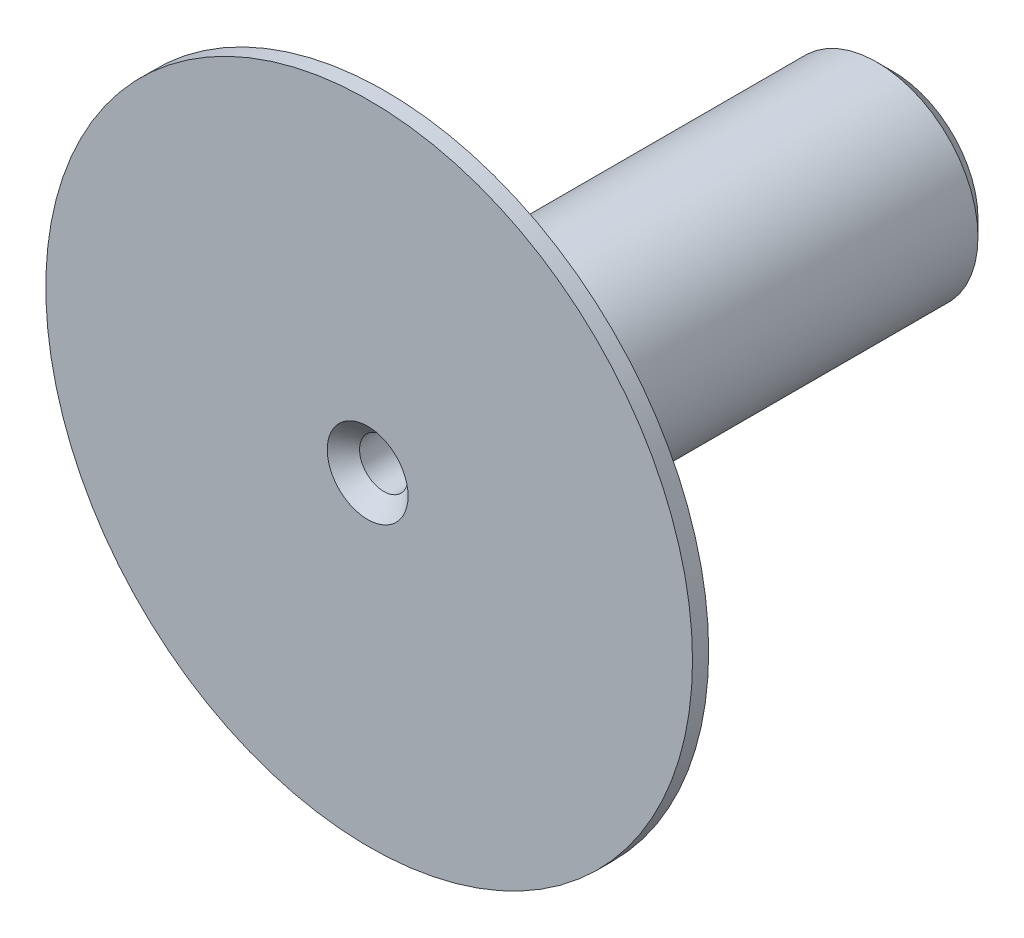
ISO-10303-21;
HEADER;
FILE_DESCRIPTION(('STEP AP214'),'2;1');
FILE_NAME('part.step','',(''),(''),'','','');
FILE_SCHEMA(('AUTOMOTIVE_DESIGN { 1 0 10303 214 1 1 1 1 }'));
ENDSEC;
DATA;
#1=APPLICATION_CONTEXT('core data for automotive mechanical design processes');
#2=APPLICATION_PROTOCOL_DEFINITION('international standard','automotive_design',2000,#1);
#3=PRODUCT_CONTEXT('',#1,'mechanical');
#4=PRODUCT('Part','Part','',(#3));
#5=PRODUCT_RELATED_PRODUCT_CATEGORY('part','',(#4));
#6=PRODUCT_DEFINITION_FORMATION('','',#4);
#7=PRODUCT_DEFINITION_CONTEXT('part definition',#1,'design');
#8=PRODUCT_DEFINITION('design','',#6,#7);
#9=PRODUCT_DEFINITION_SHAPE('','',#8);
#10=(LENGTH_UNIT() NAMED_UNIT(*) SI_UNIT(.MILLI.,.METRE.));
#11=(NAMED_UNIT(*) PLANE_ANGLE_UNIT() SI_UNIT($,.RADIAN.));
#12=(NAMED_UNIT(*) SI_UNIT($,.STERADIAN.) SOLID_ANGLE_UNIT());
#13=UNCERTAINTY_MEASURE_WITH_UNIT(LENGTH_MEASURE(1.E-05),#10,'distance_accuracy_value','');
#14=(GEOMETRIC_REPRESENTATION_CONTEXT(3) GLOBAL_UNCERTAINTY_ASSIGNED_CONTEXT((#13)) GLOBAL_UNIT_ASSIGNED_CONTEXT((#10,
#11,#12)) REPRESENTATION_CONTEXT('',''));
#15=CARTESIAN_POINT('',(0.,0.,0.));
#16=DIRECTION('',(0.,0.,1.));
#17=DIRECTION('',(1.,0.,0.));
#18=AXIS2_PLACEMENT_3D('',#15,#16,#17);
#19=CARTESIAN_POINT('',(0.,0.,6.5));
#20=DIRECTION('',(0.,0.,-1.));
#21=DIRECTION('',(-1.,0.,0.));
#22=AXIS2_PLACEMENT_3D('',#19,#20,#21);
#23=CYLINDRICAL_SURFACE('',#22,1.25);
#24=CARTESIAN_POINT('',(0.,0.,0.200000000000007));
#25=DIRECTION('',(0.,0.,1.));
#26=DIRECTION('',(1.,0.,0.));
#27=AXIS2_PLACEMENT_3D('',#24,#25,#26);
#28=CIRCLE('',#27,1.25);
#29=CARTESIAN_POINT('',(1.25,0.,0.200000000000007));
#30=VERTEX_POINT('',#29);
#31=EDGE_CURVE('E65',#30,#30,#28,.T.);
#32=ORIENTED_EDGE('',*,*,#31,.T.);
#33=EDGE_LOOP('',(#32));
#34=FACE_BOUND('',#33,.T.);
#35=CARTESIAN_POINT('',(0.,0.,6.3));
#36=DIRECTION('',(0.,0.,1.));
#37=DIRECTION('',(1.,0.,0.));
#38=AXIS2_PLACEMENT_3D('',#35,#36,#37);
#39=CIRCLE('',#38,1.25);
#40=CARTESIAN_POINT('',(1.25,0.,6.3));
#41=VERTEX_POINT('',#40);
#42=EDGE_CURVE('E68',#41,#41,#39,.T.);
#43=ORIENTED_EDGE('',*,*,#42,.F.);
#44=EDGE_LOOP('',(#43));
#45=FACE_BOUND('',#44,.T.);
#46=ADVANCED_FACE('F41',(#34,#45),#23,.T.);
#47=CARTESIAN_POINT('',(0.,0.,6.5));
#48=DIRECTION('',(0.,0.,1.));
#49=DIRECTION('',(1.,0.,0.));
#50=AXIS2_PLACEMENT_3D('',#47,#48,#49);
#51=PLANE('',#50);
#52=CARTESIAN_POINT('',(0.,0.,6.5));
#53=DIRECTION('',(0.,0.,1.));
#54=DIRECTION('',(1.,0.,0.));
#55=AXIS2_PLACEMENT_3D('',#52,#53,#54);
#56=CIRCLE('',#55,0.500000000000011);
#57=CARTESIAN_POINT('',(0.500000000000011,0.,6.5));
#58=VERTEX_POINT('',#57);
#59=EDGE_CURVE('E10',#58,#58,#56,.F.);
#60=ORIENTED_EDGE('',*,*,#59,.T.);
#61=EDGE_LOOP('',(#60));
#62=FACE_BOUND('',#61,.T.);
#63=CARTESIAN_POINT('',(0.0186698824009481,0.,6.5));
#64=DIRECTION('',(0.,0.,1.));
#65=DIRECTION('',(1.,0.,0.));
#66=AXIS2_PLACEMENT_3D('',#63,#64,#65);
#67=CIRCLE('',#66,4.);
#68=CARTESIAN_POINT('',(4.01866988240095,0.,6.5));
#69=VERTEX_POINT('',#68);
#70=EDGE_CURVE('E72',#69,#69,#67,.T.);
#71=ORIENTED_EDGE('',*,*,#70,.T.);
#72=EDGE_LOOP('',(#71));
#73=FACE_BOUND('',#72,.T.);
#74=ADVANCED_FACE('F96',(#62,#73),#51,.T.);
#75=CARTESIAN_POINT('',(0.,0.,0.));
#76=DIRECTION('',(0.,0.,1.));
#77=DIRECTION('',(1.,0.,0.));
#78=AXIS2_PLACEMENT_3D('',#75,#76,#77);
#79=PLANE('',#78);
#80=CARTESIAN_POINT('',(0.,0.,0.));
#81=DIRECTION('',(0.,0.,1.));
#82=DIRECTION('',(1.,0.,0.));
#83=AXIS2_PLACEMENT_3D('',#80,#81,#82);
#84=CIRCLE('',#83,1.04999999999999);
#85=CARTESIAN_POINT('',(1.04999999999999,0.,0.));
#86=VERTEX_POINT('',#85);
#87=EDGE_CURVE('E57',#86,#86,#84,.F.);
#88=ORIENTED_EDGE('',*,*,#87,.T.);
#89=EDGE_LOOP('',(#88));
#90=FACE_BOUND('',#89,.T.);
#91=CARTESIAN_POINT('',(0.,0.,0.));
#92=DIRECTION('',(0.,0.,1.));
#93=DIRECTION('',(1.,0.,0.));
#94=AXIS2_PLACEMENT_3D('',#91,#92,#93);
#95=CIRCLE('',#94,0.499999999999995);
#96=CARTESIAN_POINT('',(0.499999999999995,0.,0.));
#97=VERTEX_POINT('',#96);
#98=EDGE_CURVE('E62',#97,#97,#95,.T.);
#99=ORIENTED_EDGE('',*,*,#98,.T.);
#100=EDGE_LOOP('',(#99));
#101=FACE_BOUND('',#100,.T.);
#102=ADVANCED_FACE('F102',(#90,#101),#79,.F.);
#103=CARTESIAN_POINT('',(0.,0.,6.5));
#104=DIRECTION('',(0.,0.,-1.));
#105=DIRECTION('',(-1.,0.,0.));
#106=AXIS2_PLACEMENT_3D('',#103,#104,#105);
#107=CYLINDRICAL_SURFACE('',#106,0.3);
#108=CARTESIAN_POINT('',(0.,0.,0.199999999999999));
#109=DIRECTION('',(0.,0.,1.));
#110=DIRECTION('',(1.,0.,0.));
#111=AXIS2_PLACEMENT_3D('',#108,#109,#110);
#112=CIRCLE('',#111,0.3);
#113=CARTESIAN_POINT('',(0.3,0.,0.199999999999999));
#114=VERTEX_POINT('',#113);
#115=EDGE_CURVE('E49',#114,#114,#112,.F.);
#116=ORIENTED_EDGE('',*,*,#115,.T.);
#117=EDGE_LOOP('',(#116));
#118=FACE_BOUND('',#117,.T.);
#119=CARTESIAN_POINT('',(0.,0.,6.29999999999999));
#120=DIRECTION('',(0.,0.,1.));
#121=DIRECTION('',(1.,0.,0.));
#122=AXIS2_PLACEMENT_3D('',#119,#120,#121);
#123=CIRCLE('',#122,0.3);
#124=CARTESIAN_POINT('',(0.3,0.,6.29999999999999));
#125=VERTEX_POINT('',#124);
#126=EDGE_CURVE('E53',#125,#125,#123,.T.);
#127=ORIENTED_EDGE('',*,*,#126,.T.);
#128=EDGE_LOOP('',(#127));
#129=FACE_BOUND('',#128,.T.);
#130=ADVANCED_FACE('F94',(#118,#129),#107,.F.);
#131=CARTESIAN_POINT('',(0.0186698824009481,0.,6.3));
#132=DIRECTION('',(0.,0.,1.));
#133=DIRECTION('',(1.,0.,0.));
#134=AXIS2_PLACEMENT_3D('',#131,#132,#133);
#135=CYLINDRICAL_SURFACE('',#134,4.);
#136=CARTESIAN_POINT('',(0.0186698824009481,0.,6.3));
#137=DIRECTION('',(0.,0.,1.));
#138=DIRECTION('',(1.,0.,0.));
#139=AXIS2_PLACEMENT_3D('',#136,#137,#138);
#140=CIRCLE('',#139,4.);
#141=CARTESIAN_POINT('',(4.01866988240095,0.,6.3));
#142=VERTEX_POINT('',#141);
#143=EDGE_CURVE('E71',#142,#142,#140,.T.);
#144=ORIENTED_EDGE('',*,*,#143,.T.);
#145=EDGE_LOOP('',(#144));
#146=FACE_BOUND('',#145,.T.);
#147=ORIENTED_EDGE('',*,*,#70,.F.);
#148=EDGE_LOOP('',(#147));
#149=FACE_BOUND('',#148,.T.);
#150=ADVANCED_FACE('F78',(#146,#149),#135,.T.);
#151=CARTESIAN_POINT('',(0.0186698824009481,0.,6.3));
#152=DIRECTION('',(0.,0.,1.));
#153=DIRECTION('',(1.,0.,0.));
#154=AXIS2_PLACEMENT_3D('',#151,#152,#153);
#155=PLANE('',#154);
#156=ORIENTED_EDGE('',*,*,#42,.T.);
#157=EDGE_LOOP('',(#156));
#158=FACE_BOUND('',#157,.T.);
#159=ORIENTED_EDGE('',*,*,#143,.F.);
#160=EDGE_LOOP('',(#159));
#161=FACE_BOUND('',#160,.T.);
#162=ADVANCED_FACE('F81',(#158,#161),#155,.F.);
#163=CARTESIAN_POINT('',(0.,0.,0.200000000000007));
#164=DIRECTION('',(0.,0.,1.));
#165=DIRECTION('',(1.,0.,0.));
#166=AXIS2_PLACEMENT_3D('',#163,#164,#165);
#167=CONICAL_SURFACE('',#166,1.25,0.785398163397455);
#168=ORIENTED_EDGE('',*,*,#87,.F.);
#169=EDGE_LOOP('',(#168));
#170=FACE_BOUND('',#169,.T.);
#171=ORIENTED_EDGE('',*,*,#31,.F.);
#172=EDGE_LOOP('',(#171));
#173=FACE_BOUND('',#172,.T.);
#174=ADVANCED_FACE('F83',(#170,#173),#167,.T.);
#175=CARTESIAN_POINT('',(0.,0.,0.));
#176=DIRECTION('',(0.,0.,-1.));
#177=DIRECTION('',(-1.,0.,0.));
#178=AXIS2_PLACEMENT_3D('',#175,#176,#177);
#179=CONICAL_SURFACE('',#178,0.499999999999995,0.78539816339744);
#180=ORIENTED_EDGE('',*,*,#115,.F.);
#181=EDGE_LOOP('',(#180));
#182=FACE_BOUND('',#181,.T.);
#183=ORIENTED_EDGE('',*,*,#98,.F.);
#184=EDGE_LOOP('',(#183));
#185=FACE_BOUND('',#184,.T.);
#186=ADVANCED_FACE('F91',(#182,#185),#179,.F.);
#187=CARTESIAN_POINT('',(0.,0.,6.29999999999999));
#188=DIRECTION('',(0.,0.,1.));
#189=DIRECTION('',(1.,0.,0.));
#190=AXIS2_PLACEMENT_3D('',#187,#188,#189);
#191=CONICAL_SURFACE('',#190,0.3,0.785398163397452);
#192=ORIENTED_EDGE('',*,*,#59,.F.);
#193=EDGE_LOOP('',(#192));
#194=FACE_BOUND('',#193,.T.);
#195=ORIENTED_EDGE('',*,*,#126,.F.);
#196=EDGE_LOOP('',(#195));
#197=FACE_BOUND('',#196,.T.);
#198=ADVANCED_FACE('F44',(#194,#197),#191,.F.);
#199=CLOSED_SHELL('',(#46,#74,#102,#130,#150,#162,#174,#186,#198));
#200=MANIFOLD_SOLID_BREP('B2',#199);
#201=ADVANCED_BREP_SHAPE_REPRESENTATION('',(#18,#200),#14);
#202=SHAPE_DEFINITION_REPRESENTATION(#9,#201);
ENDSEC;
END-ISO-10303-21;
